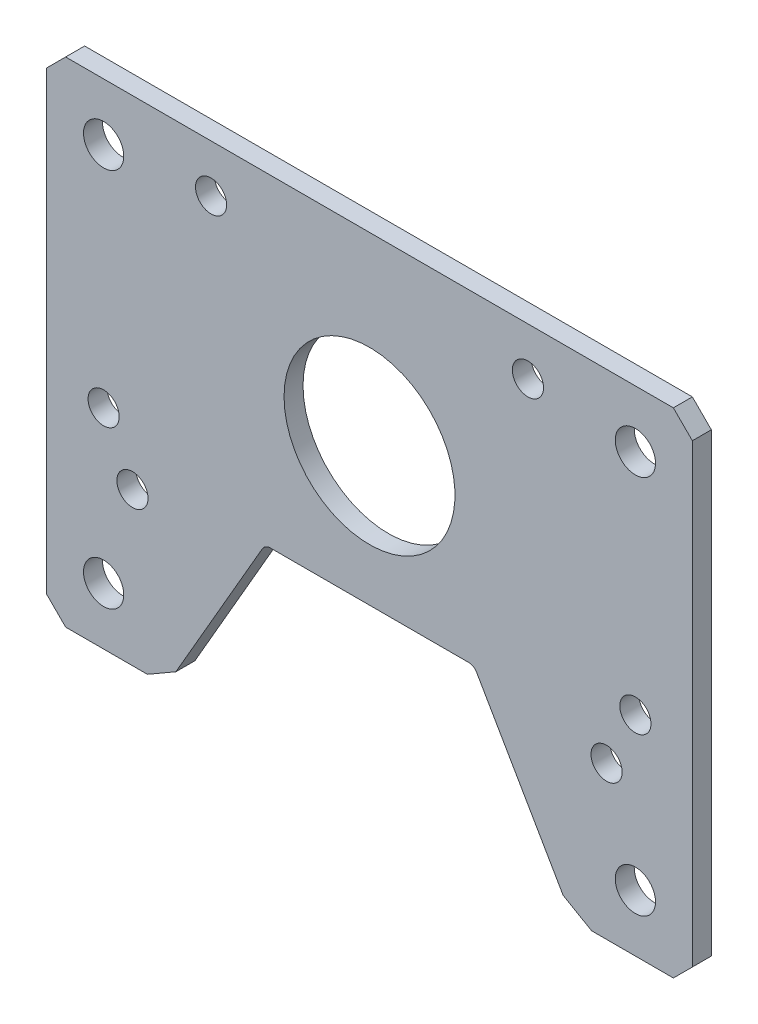
ISO-10303-21;
HEADER;
FILE_DESCRIPTION(('STEP AP214'),'2;1');
FILE_NAME('part.step','',(''),(''),'','','');
FILE_SCHEMA(('AUTOMOTIVE_DESIGN { 1 0 10303 214 1 1 1 1 }'));
ENDSEC;
DATA;
#1=APPLICATION_CONTEXT('core data for automotive mechanical design processes');
#2=APPLICATION_PROTOCOL_DEFINITION('international standard','automotive_design',2000,#1);
#3=PRODUCT_CONTEXT('',#1,'mechanical');
#4=PRODUCT('Part','Part','',(#3));
#5=PRODUCT_RELATED_PRODUCT_CATEGORY('part','',(#4));
#6=PRODUCT_DEFINITION_FORMATION('','',#4);
#7=PRODUCT_DEFINITION_CONTEXT('part definition',#1,'design');
#8=PRODUCT_DEFINITION('design','',#6,#7);
#9=PRODUCT_DEFINITION_SHAPE('','',#8);
#10=(LENGTH_UNIT() NAMED_UNIT(*) SI_UNIT(.MILLI.,.METRE.));
#11=(NAMED_UNIT(*) PLANE_ANGLE_UNIT() SI_UNIT($,.RADIAN.));
#12=(NAMED_UNIT(*) SI_UNIT($,.STERADIAN.) SOLID_ANGLE_UNIT());
#13=UNCERTAINTY_MEASURE_WITH_UNIT(LENGTH_MEASURE(1.E-05),#10,'distance_accuracy_value','');
#14=(GEOMETRIC_REPRESENTATION_CONTEXT(3) GLOBAL_UNCERTAINTY_ASSIGNED_CONTEXT((#13)) GLOBAL_UNIT_ASSIGNED_CONTEXT((#10,
#11,#12)) REPRESENTATION_CONTEXT('',''));
#15=CARTESIAN_POINT('',(0.,0.,0.));
#16=DIRECTION('',(0.,0.,1.));
#17=DIRECTION('',(1.,0.,0.));
#18=AXIS2_PLACEMENT_3D('',#15,#16,#17);
#19=CARTESIAN_POINT('',(-16.5459564476615,-1.5875,3.175));
#20=DIRECTION('',(0.,0.,1.));
#21=DIRECTION('',(1.,0.,0.));
#22=AXIS2_PLACEMENT_3D('',#19,#20,#21);
#23=CYLINDRICAL_SURFACE('',#22,1.5875);
#24=DIRECTION('',(0.,0.,1.));
#25=VECTOR('',#24,1.);
#26=CARTESIAN_POINT('',(-17.9207717761693,-0.793750000000006,3.175));
#27=LINE('',#26,#25);
#28=CARTESIAN_POINT('',(-17.9207717761693,-0.793750000000005,3.175));
#29=VERTEX_POINT('',#28);
#30=CARTESIAN_POINT('',(-17.9207717761693,-0.793750000000005,0.));
#31=VERTEX_POINT('',#30);
#32=EDGE_CURVE('E144',#29,#31,#27,.F.);
#33=ORIENTED_EDGE('',*,*,#32,.T.);
#34=CARTESIAN_POINT('',(-16.5459564476615,-1.5875,0.));
#35=DIRECTION('',(0.,0.,1.));
#36=DIRECTION('',(1.,0.,0.));
#37=AXIS2_PLACEMENT_3D('',#34,#35,#36);
#38=CIRCLE('',#37,1.5875);
#39=CARTESIAN_POINT('',(-16.5459564476615,0.,0.));
#40=VERTEX_POINT('',#39);
#41=EDGE_CURVE('E20',#40,#31,#38,.T.);
#42=ORIENTED_EDGE('',*,*,#41,.F.);
#43=DIRECTION('',(0.,0.,1.));
#44=VECTOR('',#43,1.);
#45=CARTESIAN_POINT('',(-16.5459564476615,0.,3.175));
#46=LINE('',#45,#44);
#47=CARTESIAN_POINT('',(-16.5459564476615,0.,3.175));
#48=VERTEX_POINT('',#47);
#49=EDGE_CURVE('E149',#40,#48,#46,.T.);
#50=ORIENTED_EDGE('',*,*,#49,.T.);
#51=CARTESIAN_POINT('',(-16.5459564476615,-1.5875,3.175));
#52=DIRECTION('',(0.,0.,1.));
#53=DIRECTION('',(1.,0.,0.));
#54=AXIS2_PLACEMENT_3D('',#51,#52,#53);
#55=CIRCLE('',#54,1.5875);
#56=EDGE_CURVE('E145',#29,#48,#55,.F.);
#57=ORIENTED_EDGE('',*,*,#56,.F.);
#58=EDGE_LOOP('',(#33,#42,#50,#57));
#59=FACE_BOUND('',#58,.T.);
#60=ADVANCED_FACE('F17',(#59),#23,.F.);
#61=CARTESIAN_POINT('',(16.5459564476615,-1.5875,3.175));
#62=DIRECTION('',(0.,0.,1.));
#63=DIRECTION('',(1.,0.,0.));
#64=AXIS2_PLACEMENT_3D('',#61,#62,#63);
#65=CYLINDRICAL_SURFACE('',#64,1.5875);
#66=DIRECTION('',(0.,0.,1.));
#67=VECTOR('',#66,1.);
#68=CARTESIAN_POINT('',(16.5459564476615,0.,3.175));
#69=LINE('',#68,#67);
#70=CARTESIAN_POINT('',(16.5459564476615,0.,3.175));
#71=VERTEX_POINT('',#70);
#72=CARTESIAN_POINT('',(16.5459564476615,0.,0.));
#73=VERTEX_POINT('',#72);
#74=EDGE_CURVE('E203',#71,#73,#69,.F.);
#75=ORIENTED_EDGE('',*,*,#74,.T.);
#76=CARTESIAN_POINT('',(16.5459564476615,-1.5875,0.));
#77=DIRECTION('',(0.,0.,1.));
#78=DIRECTION('',(1.,0.,0.));
#79=AXIS2_PLACEMENT_3D('',#76,#77,#78);
#80=CIRCLE('',#79,1.5875);
#81=CARTESIAN_POINT('',(17.9207717761693,-0.793749999999998,0.));
#82=VERTEX_POINT('',#81);
#83=EDGE_CURVE('E142',#82,#73,#80,.T.);
#84=ORIENTED_EDGE('',*,*,#83,.F.);
#85=DIRECTION('',(0.,0.,1.));
#86=VECTOR('',#85,1.);
#87=CARTESIAN_POINT('',(17.9207717761693,-0.793749999999998,3.175));
#88=LINE('',#87,#86);
#89=CARTESIAN_POINT('',(17.9207717761693,-0.793749999999998,3.175));
#90=VERTEX_POINT('',#89);
#91=EDGE_CURVE('E199',#82,#90,#88,.T.);
#92=ORIENTED_EDGE('',*,*,#91,.T.);
#93=CARTESIAN_POINT('',(16.5459564476615,-1.5875,3.175));
#94=DIRECTION('',(0.,0.,1.));
#95=DIRECTION('',(1.,0.,0.));
#96=AXIS2_PLACEMENT_3D('',#93,#94,#95);
#97=CIRCLE('',#96,1.5875);
#98=EDGE_CURVE('E341',#71,#90,#97,.F.);
#99=ORIENTED_EDGE('',*,*,#98,.F.);
#100=EDGE_LOOP('',(#75,#84,#92,#99));
#101=FACE_BOUND('',#100,.T.);
#102=ADVANCED_FACE('F349',(#101),#65,.F.);
#103=CARTESIAN_POINT('',(-53.975,-28.575,3.175));
#104=DIRECTION('',(0.,0.,1.));
#105=DIRECTION('',(1.,0.,0.));
#106=AXIS2_PLACEMENT_3D('',#103,#104,#105);
#107=PLANE('',#106);
#108=CARTESIAN_POINT('',(44.45,6.35000000000001,3.175));
#109=DIRECTION('',(0.,0.,-1.));
#110=DIRECTION('',(-1.,0.,0.));
#111=AXIS2_PLACEMENT_3D('',#108,#109,#110);
#112=CIRCLE('',#111,2.6035);
#113=CARTESIAN_POINT('',(41.8465,6.35000000000001,3.175));
#114=VERTEX_POINT('',#113);
#115=EDGE_CURVE('E310',#114,#114,#112,.T.);
#116=ORIENTED_EDGE('',*,*,#115,.T.);
#117=EDGE_LOOP('',(#116));
#118=FACE_BOUND('',#117,.T.);
#119=CARTESIAN_POINT('',(26.4841012047918,46.0057498114846,3.175));
#120=DIRECTION('',(0.,0.,-1.));
#121=DIRECTION('',(-1.,0.,0.));
#122=AXIS2_PLACEMENT_3D('',#119,#120,#121);
#123=CIRCLE('',#122,2.6035);
#124=CARTESIAN_POINT('',(23.8806012047918,46.0057498114846,3.175));
#125=VERTEX_POINT('',#124);
#126=EDGE_CURVE('E313',#125,#125,#123,.T.);
#127=ORIENTED_EDGE('',*,*,#126,.T.);
#128=EDGE_LOOP('',(#127));
#129=FACE_BOUND('',#128,.T.);
#130=CARTESIAN_POINT('',(-39.632108696,-3.06328216400001,3.175));
#131=DIRECTION('',(0.,0.,-1.));
#132=DIRECTION('',(-1.,0.,0.));
#133=AXIS2_PLACEMENT_3D('',#130,#131,#132);
#134=CIRCLE('',#133,2.6035);
#135=CARTESIAN_POINT('',(-42.235608696,-3.06328216400001,3.175));
#136=VERTEX_POINT('',#135);
#137=EDGE_CURVE('E316',#136,#136,#134,.T.);
#138=ORIENTED_EDGE('',*,*,#137,.T.);
#139=EDGE_LOOP('',(#138));
#140=FACE_BOUND('',#139,.T.);
#141=CARTESIAN_POINT('',(44.45,-19.05,3.175));
#142=DIRECTION('',(0.,0.,-1.));
#143=DIRECTION('',(-1.,0.,0.));
#144=AXIS2_PLACEMENT_3D('',#141,#142,#143);
#145=CIRCLE('',#144,3.3655);
#146=CARTESIAN_POINT('',(41.0845,-19.05,3.175));
#147=VERTEX_POINT('',#146);
#148=EDGE_CURVE('E319',#147,#147,#145,.T.);
#149=ORIENTED_EDGE('',*,*,#148,.T.);
#150=EDGE_LOOP('',(#149));
#151=FACE_BOUND('',#150,.T.);
#152=CARTESIAN_POINT('',(44.45,44.45,3.175));
#153=DIRECTION('',(0.,0.,-1.));
#154=DIRECTION('',(-1.,0.,0.));
#155=AXIS2_PLACEMENT_3D('',#152,#153,#154);
#156=CIRCLE('',#155,3.3655);
#157=CARTESIAN_POINT('',(41.0845,44.45,3.175));
#158=VERTEX_POINT('',#157);
#159=EDGE_CURVE('E322',#158,#158,#156,.T.);
#160=ORIENTED_EDGE('',*,*,#159,.T.);
#161=EDGE_LOOP('',(#160));
#162=FACE_BOUND('',#161,.T.);
#163=CARTESIAN_POINT('',(0.,23.058733918,3.175));
#164=DIRECTION('',(0.,0.,-1.));
#165=DIRECTION('',(-1.,0.,0.));
#166=AXIS2_PLACEMENT_3D('',#163,#164,#165);
#167=CIRCLE('',#166,14.2875);
#168=CARTESIAN_POINT('',(-14.2875,23.058733918,3.175));
#169=VERTEX_POINT('',#168);
#170=EDGE_CURVE('E263',#169,#169,#167,.T.);
#171=ORIENTED_EDGE('',*,*,#170,.T.);
#172=EDGE_LOOP('',(#171));
#173=FACE_BOUND('',#172,.T.);
#174=DIRECTION('',(0.,1.,0.));
#175=VECTOR('',#174,1.);
#176=CARTESIAN_POINT('',(53.975,53.975,3.175));
#177=LINE('',#176,#175);
#178=CARTESIAN_POINT('',(53.975,-25.4,3.175));
#179=VERTEX_POINT('',#178);
#180=CARTESIAN_POINT('',(53.975,50.8,3.175));
#181=VERTEX_POINT('',#180);
#182=EDGE_CURVE('E183',#179,#181,#177,.T.);
#183=ORIENTED_EDGE('',*,*,#182,.T.);
#184=DIRECTION('',(0.707106781186548,-0.707106781186548,0.));
#185=VECTOR('',#184,1.);
#186=CARTESIAN_POINT('',(50.8,53.975,3.175));
#187=LINE('',#186,#185);
#188=CARTESIAN_POINT('',(50.8,53.975,3.175));
#189=VERTEX_POINT('',#188);
#190=EDGE_CURVE('E178',#181,#189,#187,.F.);
#191=ORIENTED_EDGE('',*,*,#190,.T.);
#192=DIRECTION('',(1.,0.,0.));
#193=VECTOR('',#192,1.);
#194=CARTESIAN_POINT('',(-53.975,53.975,3.175));
#195=LINE('',#194,#193);
#196=CARTESIAN_POINT('',(-50.8,53.975,3.175));
#197=VERTEX_POINT('',#196);
#198=EDGE_CURVE('E173',#189,#197,#195,.F.);
#199=ORIENTED_EDGE('',*,*,#198,.T.);
#200=DIRECTION('',(0.707106781186548,0.707106781186548,0.));
#201=VECTOR('',#200,1.);
#202=CARTESIAN_POINT('',(-53.975,50.8,3.175));
#203=LINE('',#202,#201);
#204=CARTESIAN_POINT('',(-53.975,50.8,3.175));
#205=VERTEX_POINT('',#204);
#206=EDGE_CURVE('E168',#197,#205,#203,.F.);
#207=ORIENTED_EDGE('',*,*,#206,.T.);
#208=DIRECTION('',(0.,1.,0.));
#209=VECTOR('',#208,1.);
#210=CARTESIAN_POINT('',(-53.975,53.975,3.175));
#211=LINE('',#210,#209);
#212=CARTESIAN_POINT('',(-53.975,-25.4,3.175));
#213=VERTEX_POINT('',#212);
#214=EDGE_CURVE('E166',#205,#213,#211,.F.);
#215=ORIENTED_EDGE('',*,*,#214,.T.);
#216=DIRECTION('',(-0.707106781186548,0.707106781186548,0.));
#217=VECTOR('',#216,1.);
#218=CARTESIAN_POINT('',(-50.8,-28.575,3.175));
#219=LINE('',#218,#217);
#220=CARTESIAN_POINT('',(-50.8,-28.575,3.175));
#221=VERTEX_POINT('',#220);
#222=EDGE_CURVE('E239',#213,#221,#219,.F.);
#223=ORIENTED_EDGE('',*,*,#222,.T.);
#224=DIRECTION('',(1.,0.,0.));
#225=VECTOR('',#224,1.);
#226=CARTESIAN_POINT('',(-53.975,-28.575,3.175));
#227=LINE('',#226,#225);
#228=CARTESIAN_POINT('',(-37.1352839420935,-28.575,3.175));
#229=VERTEX_POINT('',#228);
#230=EDGE_CURVE('E228',#221,#229,#227,.T.);
#231=ORIENTED_EDGE('',*,*,#230,.T.);
#232=DIRECTION('',(-0.866025403784438,-0.500000000000002,0.));
#233=VECTOR('',#232,1.);
#234=CARTESIAN_POINT('',(-32.3727839420934,-25.8253693429844,3.175));
#235=LINE('',#234,#233);
#236=CARTESIAN_POINT('',(-32.3727839420934,-25.8253693429844,3.175));
#237=VERTEX_POINT('',#236);
#238=EDGE_CURVE('E220',#229,#237,#235,.F.);
#239=ORIENTED_EDGE('',*,*,#238,.T.);
#240=DIRECTION('',(-0.499999999999998,-0.86602540378444,0.));
#241=VECTOR('',#240,1.);
#242=CARTESIAN_POINT('',(-33.9602839420935,-28.575,3.175));
#243=LINE('',#242,#241);
#244=EDGE_CURVE('E150',#237,#29,#243,.F.);
#245=ORIENTED_EDGE('',*,*,#244,.T.);
#246=ORIENTED_EDGE('',*,*,#56,.T.);
#247=DIRECTION('',(-1.,0.,0.));
#248=VECTOR('',#247,1.);
#249=CARTESIAN_POINT('',(-17.4625,0.,3.175));
#250=LINE('',#249,#248);
#251=EDGE_CURVE('E216',#48,#71,#250,.F.);
#252=ORIENTED_EDGE('',*,*,#251,.T.);
#253=ORIENTED_EDGE('',*,*,#98,.T.);
#254=DIRECTION('',(-0.499999999999998,0.86602540378444,0.));
#255=VECTOR('',#254,1.);
#256=CARTESIAN_POINT('',(17.4625,0.,3.175));
#257=LINE('',#256,#255);
#258=CARTESIAN_POINT('',(32.3727839420935,-25.8253693429844,3.175));
#259=VERTEX_POINT('',#258);
#260=EDGE_CURVE('E202',#90,#259,#257,.F.);
#261=ORIENTED_EDGE('',*,*,#260,.T.);
#262=DIRECTION('',(-0.866025403784438,0.500000000000001,0.));
#263=VECTOR('',#262,1.);
#264=CARTESIAN_POINT('',(37.1352839420935,-28.575,3.175));
#265=LINE('',#264,#263);
#266=CARTESIAN_POINT('',(37.1352839420935,-28.575,3.175));
#267=VERTEX_POINT('',#266);
#268=EDGE_CURVE('E198',#259,#267,#265,.F.);
#269=ORIENTED_EDGE('',*,*,#268,.T.);
#270=DIRECTION('',(-1.,0.,0.));
#271=VECTOR('',#270,1.);
#272=CARTESIAN_POINT('',(33.9602839420935,-28.575,3.175));
#273=LINE('',#272,#271);
#274=CARTESIAN_POINT('',(50.8,-28.575,3.175));
#275=VERTEX_POINT('',#274);
#276=EDGE_CURVE('E193',#267,#275,#273,.F.);
#277=ORIENTED_EDGE('',*,*,#276,.T.);
#278=DIRECTION('',(-0.707106781186548,-0.707106781186548,0.));
#279=VECTOR('',#278,1.);
#280=CARTESIAN_POINT('',(53.975,-25.4,3.175));
#281=LINE('',#280,#279);
#282=EDGE_CURVE('E188',#275,#179,#281,.F.);
#283=ORIENTED_EDGE('',*,*,#282,.T.);
#284=EDGE_LOOP('',(#183,#191,#199,#207,#215,#223,#231,#239,#245,#246,#252,#253,#261,#269,#277,#283));
#285=FACE_BOUND('',#284,.T.);
#286=CARTESIAN_POINT('',(-44.45,44.45,3.175));
#287=DIRECTION('',(0.,0.,-1.));
#288=DIRECTION('',(-1.,0.,0.));
#289=AXIS2_PLACEMENT_3D('',#286,#287,#288);
#290=CIRCLE('',#289,3.3655);
#291=CARTESIAN_POINT('',(-47.8155,44.45,3.175));
#292=VERTEX_POINT('',#291);
#293=EDGE_CURVE('E258',#292,#292,#290,.T.);
#294=ORIENTED_EDGE('',*,*,#293,.T.);
#295=EDGE_LOOP('',(#294));
#296=FACE_BOUND('',#295,.T.);
#297=CARTESIAN_POINT('',(-44.45,-19.05,3.175));
#298=DIRECTION('',(0.,0.,-1.));
#299=DIRECTION('',(-1.,0.,0.));
#300=AXIS2_PLACEMENT_3D('',#297,#298,#299);
#301=CIRCLE('',#300,3.3655);
#302=CARTESIAN_POINT('',(-47.8155,-19.05,3.175));
#303=VERTEX_POINT('',#302);
#304=EDGE_CURVE('E329',#303,#303,#301,.T.);
#305=ORIENTED_EDGE('',*,*,#304,.T.);
#306=EDGE_LOOP('',(#305));
#307=FACE_BOUND('',#306,.T.);
#308=CARTESIAN_POINT('',(-44.45,6.34999999999999,3.175));
#309=DIRECTION('',(0.,0.,-1.));
#310=DIRECTION('',(-1.,0.,0.));
#311=AXIS2_PLACEMENT_3D('',#308,#309,#310);
#312=CIRCLE('',#311,2.6035);
#313=CARTESIAN_POINT('',(-47.0535,6.34999999999999,3.175));
#314=VERTEX_POINT('',#313);
#315=EDGE_CURVE('E332',#314,#314,#312,.T.);
#316=ORIENTED_EDGE('',*,*,#315,.T.);
#317=EDGE_LOOP('',(#316));
#318=FACE_BOUND('',#317,.T.);
#319=CARTESIAN_POINT('',(-26.4841012047918,46.0057498114846,3.175));
#320=DIRECTION('',(0.,0.,-1.));
#321=DIRECTION('',(-1.,0.,0.));
#322=AXIS2_PLACEMENT_3D('',#319,#320,#321);
#323=CIRCLE('',#322,2.6035);
#324=CARTESIAN_POINT('',(-29.0876012047918,46.0057498114846,3.175));
#325=VERTEX_POINT('',#324);
#326=EDGE_CURVE('E335',#325,#325,#323,.T.);
#327=ORIENTED_EDGE('',*,*,#326,.T.);
#328=EDGE_LOOP('',(#327));
#329=FACE_BOUND('',#328,.T.);
#330=CARTESIAN_POINT('',(39.632108696,-3.06328216400001,3.175));
#331=DIRECTION('',(0.,0.,-1.));
#332=DIRECTION('',(-1.,0.,0.));
#333=AXIS2_PLACEMENT_3D('',#330,#331,#332);
#334=CIRCLE('',#333,2.6035);
#335=CARTESIAN_POINT('',(37.028608696,-3.06328216400001,3.175));
#336=VERTEX_POINT('',#335);
#337=EDGE_CURVE('E338',#336,#336,#334,.T.);
#338=ORIENTED_EDGE('',*,*,#337,.T.);
#339=EDGE_LOOP('',(#338));
#340=FACE_BOUND('',#339,.T.);
#341=ADVANCED_FACE('F354',(#118,#129,#140,#151,#162,#173,#285,#296,#307,#318,#329,#340),#107,.T.);
#342=CARTESIAN_POINT('',(39.632108696,-3.06328216400001,3.175));
#343=DIRECTION('',(0.,0.,-1.));
#344=DIRECTION('',(-1.,0.,0.));
#345=AXIS2_PLACEMENT_3D('',#342,#343,#344);
#346=CYLINDRICAL_SURFACE('',#345,2.6035);
#347=CARTESIAN_POINT('',(39.632108696,-3.06328216400001,0.));
#348=DIRECTION('',(0.,0.,-1.));
#349=DIRECTION('',(-1.,0.,0.));
#350=AXIS2_PLACEMENT_3D('',#347,#348,#349);
#351=CIRCLE('',#350,2.6035);
#352=CARTESIAN_POINT('',(37.028608696,-3.06328216400001,0.));
#353=VERTEX_POINT('',#352);
#354=EDGE_CURVE('E307',#353,#353,#351,.T.);
#355=ORIENTED_EDGE('',*,*,#354,.T.);
#356=EDGE_LOOP('',(#355));
#357=FACE_BOUND('',#356,.T.);
#358=ORIENTED_EDGE('',*,*,#337,.F.);
#359=EDGE_LOOP('',(#358));
#360=FACE_BOUND('',#359,.T.);
#361=ADVANCED_FACE('F460',(#357,#360),#346,.F.);
#362=CARTESIAN_POINT('',(-26.4841012047918,46.0057498114846,3.175));
#363=DIRECTION('',(0.,0.,-1.));
#364=DIRECTION('',(-1.,0.,0.));
#365=AXIS2_PLACEMENT_3D('',#362,#363,#364);
#366=CYLINDRICAL_SURFACE('',#365,2.6035);
#367=CARTESIAN_POINT('',(-26.4841012047918,46.0057498114846,0.));
#368=DIRECTION('',(0.,0.,-1.));
#369=DIRECTION('',(-1.,0.,0.));
#370=AXIS2_PLACEMENT_3D('',#367,#368,#369);
#371=CIRCLE('',#370,2.6035);
#372=CARTESIAN_POINT('',(-29.0876012047918,46.0057498114846,0.));
#373=VERTEX_POINT('',#372);
#374=EDGE_CURVE('E304',#373,#373,#371,.T.);
#375=ORIENTED_EDGE('',*,*,#374,.T.);
#376=EDGE_LOOP('',(#375));
#377=FACE_BOUND('',#376,.T.);
#378=ORIENTED_EDGE('',*,*,#326,.F.);
#379=EDGE_LOOP('',(#378));
#380=FACE_BOUND('',#379,.T.);
#381=ADVANCED_FACE('F469',(#377,#380),#366,.F.);
#382=CARTESIAN_POINT('',(-44.45,6.34999999999999,3.175));
#383=DIRECTION('',(0.,0.,-1.));
#384=DIRECTION('',(-1.,0.,0.));
#385=AXIS2_PLACEMENT_3D('',#382,#383,#384);
#386=CYLINDRICAL_SURFACE('',#385,2.6035);
#387=CARTESIAN_POINT('',(-44.45,6.34999999999999,0.));
#388=DIRECTION('',(0.,0.,-1.));
#389=DIRECTION('',(-1.,0.,0.));
#390=AXIS2_PLACEMENT_3D('',#387,#388,#389);
#391=CIRCLE('',#390,2.6035);
#392=CARTESIAN_POINT('',(-47.0535,6.34999999999999,0.));
#393=VERTEX_POINT('',#392);
#394=EDGE_CURVE('E301',#393,#393,#391,.T.);
#395=ORIENTED_EDGE('',*,*,#394,.T.);
#396=EDGE_LOOP('',(#395));
#397=FACE_BOUND('',#396,.T.);
#398=ORIENTED_EDGE('',*,*,#315,.F.);
#399=EDGE_LOOP('',(#398));
#400=FACE_BOUND('',#399,.T.);
#401=ADVANCED_FACE('F476',(#397,#400),#386,.F.);
#402=CARTESIAN_POINT('',(-44.45,-19.05,3.175));
#403=DIRECTION('',(0.,0.,-1.));
#404=DIRECTION('',(-1.,0.,0.));
#405=AXIS2_PLACEMENT_3D('',#402,#403,#404);
#406=CYLINDRICAL_SURFACE('',#405,3.3655);
#407=CARTESIAN_POINT('',(-44.45,-19.05,0.));
#408=DIRECTION('',(0.,0.,-1.));
#409=DIRECTION('',(-1.,0.,0.));
#410=AXIS2_PLACEMENT_3D('',#407,#408,#409);
#411=CIRCLE('',#410,3.3655);
#412=CARTESIAN_POINT('',(-47.8155,-19.05,0.));
#413=VERTEX_POINT('',#412);
#414=EDGE_CURVE('E298',#413,#413,#411,.T.);
#415=ORIENTED_EDGE('',*,*,#414,.T.);
#416=EDGE_LOOP('',(#415));
#417=FACE_BOUND('',#416,.T.);
#418=ORIENTED_EDGE('',*,*,#304,.F.);
#419=EDGE_LOOP('',(#418));
#420=FACE_BOUND('',#419,.T.);
#421=ADVANCED_FACE('F480',(#417,#420),#406,.F.);
#422=CARTESIAN_POINT('',(-44.45,44.45,3.175));
#423=DIRECTION('',(0.,0.,-1.));
#424=DIRECTION('',(-1.,0.,0.));
#425=AXIS2_PLACEMENT_3D('',#422,#423,#424);
#426=CYLINDRICAL_SURFACE('',#425,3.3655);
#427=CARTESIAN_POINT('',(-44.45,44.45,0.));
#428=DIRECTION('',(0.,0.,-1.));
#429=DIRECTION('',(-1.,0.,0.));
#430=AXIS2_PLACEMENT_3D('',#427,#428,#429);
#431=CIRCLE('',#430,3.3655);
#432=CARTESIAN_POINT('',(-47.8155,44.45,0.));
#433=VERTEX_POINT('',#432);
#434=EDGE_CURVE('E244',#433,#433,#431,.T.);
#435=ORIENTED_EDGE('',*,*,#434,.T.);
#436=EDGE_LOOP('',(#435));
#437=FACE_BOUND('',#436,.T.);
#438=ORIENTED_EDGE('',*,*,#293,.F.);
#439=EDGE_LOOP('',(#438));
#440=FACE_BOUND('',#439,.T.);
#441=ADVANCED_FACE('F484',(#437,#440),#426,.F.);
#442=CARTESIAN_POINT('',(-50.8,-28.575,3.175));
#443=DIRECTION('',(0.707106781186548,0.707106781186548,0.));
#444=DIRECTION('',(-0.707106781186548,0.707106781186548,0.));
#445=AXIS2_PLACEMENT_3D('',#442,#443,#444);
#446=PLANE('',#445);
#447=DIRECTION('',(0.,0.,-1.));
#448=VECTOR('',#447,1.);
#449=CARTESIAN_POINT('',(-53.975,-25.4,3.175));
#450=LINE('',#449,#448);
#451=CARTESIAN_POINT('',(-53.975,-25.4,0.));
#452=VERTEX_POINT('',#451);
#453=EDGE_CURVE('E167',#213,#452,#450,.T.);
#454=ORIENTED_EDGE('',*,*,#453,.T.);
#455=DIRECTION('',(0.707106781186547,-0.707106781186547,0.));
#456=VECTOR('',#455,1.);
#457=CARTESIAN_POINT('',(-53.975,-25.4,0.));
#458=LINE('',#457,#456);
#459=CARTESIAN_POINT('',(-50.8,-28.575,0.));
#460=VERTEX_POINT('',#459);
#461=EDGE_CURVE('E233',#452,#460,#458,.T.);
#462=ORIENTED_EDGE('',*,*,#461,.T.);
#463=DIRECTION('',(0.,0.,1.));
#464=VECTOR('',#463,1.);
#465=CARTESIAN_POINT('',(-50.8,-28.575,3.175));
#466=LINE('',#465,#464);
#467=EDGE_CURVE('E236',#460,#221,#466,.T.);
#468=ORIENTED_EDGE('',*,*,#467,.T.);
#469=ORIENTED_EDGE('',*,*,#222,.F.);
#470=EDGE_LOOP('',(#454,#462,#468,#469));
#471=FACE_BOUND('',#470,.T.);
#472=ADVANCED_FACE('F365',(#471),#446,.F.);
#473=CARTESIAN_POINT('',(-53.975,-28.575,3.175));
#474=DIRECTION('',(0.,1.,0.));
#475=DIRECTION('',(0.,0.,1.));
#476=AXIS2_PLACEMENT_3D('',#473,#474,#475);
#477=PLANE('',#476);
#478=DIRECTION('',(0.,0.,1.));
#479=VECTOR('',#478,1.);
#480=CARTESIAN_POINT('',(-37.1352839420935,-28.575,3.175));
#481=LINE('',#480,#479);
#482=CARTESIAN_POINT('',(-37.1352839420935,-28.575,0.));
#483=VERTEX_POINT('',#482);
#484=EDGE_CURVE('E225',#483,#229,#481,.T.);
#485=ORIENTED_EDGE('',*,*,#484,.T.);
#486=ORIENTED_EDGE('',*,*,#230,.F.);
#487=ORIENTED_EDGE('',*,*,#467,.F.);
#488=DIRECTION('',(1.,0.,0.));
#489=VECTOR('',#488,1.);
#490=CARTESIAN_POINT('',(-53.975,-28.575,0.));
#491=LINE('',#490,#489);
#492=EDGE_CURVE('E159',#460,#483,#491,.T.);
#493=ORIENTED_EDGE('',*,*,#492,.T.);
#494=EDGE_LOOP('',(#485,#486,#487,#493));
#495=FACE_BOUND('',#494,.T.);
#496=ADVANCED_FACE('F362',(#495),#477,.F.);
#497=CARTESIAN_POINT('',(-32.3727839420934,-25.8253693429844,3.175));
#498=DIRECTION('',(-0.500000000000002,0.866025403784438,0.));
#499=DIRECTION('',(-0.866025403784438,-0.500000000000002,0.));
#500=AXIS2_PLACEMENT_3D('',#497,#498,#499);
#501=PLANE('',#500);
#502=ORIENTED_EDGE('',*,*,#484,.F.);
#503=DIRECTION('',(0.866025403784438,0.500000000000002,0.));
#504=VECTOR('',#503,1.);
#505=CARTESIAN_POINT('',(-37.1352839420935,-28.575,0.));
#506=LINE('',#505,#504);
#507=CARTESIAN_POINT('',(-32.3727839420934,-25.8253693429844,0.));
#508=VERTEX_POINT('',#507);
#509=EDGE_CURVE('E155',#483,#508,#506,.T.);
#510=ORIENTED_EDGE('',*,*,#509,.T.);
#511=DIRECTION('',(0.,0.,1.));
#512=VECTOR('',#511,1.);
#513=CARTESIAN_POINT('',(-32.3727839420934,-25.8253693429844,3.175));
#514=LINE('',#513,#512);
#515=EDGE_CURVE('E154',#508,#237,#514,.T.);
#516=ORIENTED_EDGE('',*,*,#515,.T.);
#517=ORIENTED_EDGE('',*,*,#238,.F.);
#518=EDGE_LOOP('',(#502,#510,#516,#517));
#519=FACE_BOUND('',#518,.T.);
#520=ADVANCED_FACE('F359',(#519),#501,.F.);
#521=CARTESIAN_POINT('',(-33.9602839420935,-28.575,3.175));
#522=DIRECTION('',(-0.86602540378444,0.499999999999998,0.));
#523=DIRECTION('',(-0.499999999999998,-0.86602540378444,0.));
#524=AXIS2_PLACEMENT_3D('',#521,#522,#523);
#525=PLANE('',#524);
#526=ORIENTED_EDGE('',*,*,#32,.F.);
#527=ORIENTED_EDGE('',*,*,#244,.F.);
#528=ORIENTED_EDGE('',*,*,#515,.F.);
#529=DIRECTION('',(0.499999999999998,0.86602540378444,0.));
#530=VECTOR('',#529,1.);
#531=CARTESIAN_POINT('',(-32.3727839420934,-25.8253693429844,0.));
#532=LINE('',#531,#530);
#533=EDGE_CURVE('E138',#508,#31,#532,.T.);
#534=ORIENTED_EDGE('',*,*,#533,.T.);
#535=EDGE_LOOP('',(#526,#527,#528,#534));
#536=FACE_BOUND('',#535,.T.);
#537=ADVANCED_FACE('F152',(#536),#525,.F.);
#538=CARTESIAN_POINT('',(-17.4625,0.,3.175));
#539=DIRECTION('',(0.,1.,0.));
#540=DIRECTION('',(-1.,0.,0.));
#541=AXIS2_PLACEMENT_3D('',#538,#539,#540);
#542=PLANE('',#541);
#543=ORIENTED_EDGE('',*,*,#74,.F.);
#544=ORIENTED_EDGE('',*,*,#251,.F.);
#545=ORIENTED_EDGE('',*,*,#49,.F.);
#546=DIRECTION('',(1.,0.,0.));
#547=VECTOR('',#546,1.);
#548=CARTESIAN_POINT('',(-53.975,0.,0.));
#549=LINE('',#548,#547);
#550=EDGE_CURVE('E141',#40,#73,#549,.T.);
#551=ORIENTED_EDGE('',*,*,#550,.T.);
#552=EDGE_LOOP('',(#543,#544,#545,#551));
#553=FACE_BOUND('',#552,.T.);
#554=ADVANCED_FACE('F352',(#553),#542,.F.);
#555=CARTESIAN_POINT('',(17.4625,0.,3.175));
#556=DIRECTION('',(0.86602540378444,0.499999999999998,0.));
#557=DIRECTION('',(-0.499999999999998,0.86602540378444,0.));
#558=AXIS2_PLACEMENT_3D('',#555,#556,#557);
#559=PLANE('',#558);
#560=ORIENTED_EDGE('',*,*,#91,.F.);
#561=DIRECTION('',(0.499999999999998,-0.86602540378444,0.));
#562=VECTOR('',#561,1.);
#563=CARTESIAN_POINT('',(17.9207717761693,-0.793749999999999,0.));
#564=LINE('',#563,#562);
#565=CARTESIAN_POINT('',(32.3727839420934,-25.8253693429844,0.));
#566=VERTEX_POINT('',#565);
#567=EDGE_CURVE('E157',#82,#566,#564,.T.);
#568=ORIENTED_EDGE('',*,*,#567,.T.);
#569=DIRECTION('',(0.,0.,1.));
#570=VECTOR('',#569,1.);
#571=CARTESIAN_POINT('',(32.3727839420935,-25.8253693429844,3.175));
#572=LINE('',#571,#570);
#573=EDGE_CURVE('E210',#566,#259,#572,.T.);
#574=ORIENTED_EDGE('',*,*,#573,.T.);
#575=ORIENTED_EDGE('',*,*,#260,.F.);
#576=EDGE_LOOP('',(#560,#568,#574,#575));
#577=FACE_BOUND('',#576,.T.);
#578=ADVANCED_FACE('F390',(#577),#559,.F.);
#579=CARTESIAN_POINT('',(37.1352839420935,-28.575,3.175));
#580=DIRECTION('',(0.500000000000001,0.866025403784438,0.));
#581=DIRECTION('',(-0.866025403784438,0.500000000000001,0.));
#582=AXIS2_PLACEMENT_3D('',#579,#580,#581);
#583=PLANE('',#582);
#584=ORIENTED_EDGE('',*,*,#573,.F.);
#585=DIRECTION('',(0.866025403784438,-0.5,0.));
#586=VECTOR('',#585,1.);
#587=CARTESIAN_POINT('',(32.3727839420934,-25.8253693429844,0.));
#588=LINE('',#587,#586);
#589=CARTESIAN_POINT('',(37.1352839420935,-28.575,0.));
#590=VERTEX_POINT('',#589);
#591=EDGE_CURVE('E204',#566,#590,#588,.T.);
#592=ORIENTED_EDGE('',*,*,#591,.T.);
#593=DIRECTION('',(0.,0.,1.));
#594=VECTOR('',#593,1.);
#595=CARTESIAN_POINT('',(37.1352839420935,-28.575,3.175));
#596=LINE('',#595,#594);
#597=EDGE_CURVE('E195',#590,#267,#596,.T.);
#598=ORIENTED_EDGE('',*,*,#597,.T.);
#599=ORIENTED_EDGE('',*,*,#268,.F.);
#600=EDGE_LOOP('',(#584,#592,#598,#599));
#601=FACE_BOUND('',#600,.T.);
#602=ADVANCED_FACE('F394',(#601),#583,.F.);
#603=CARTESIAN_POINT('',(33.9602839420935,-28.575,3.175));
#604=DIRECTION('',(0.,1.,0.));
#605=DIRECTION('',(-1.,0.,0.));
#606=AXIS2_PLACEMENT_3D('',#603,#604,#605);
#607=PLANE('',#606);
#608=DIRECTION('',(0.,0.,1.));
#609=VECTOR('',#608,1.);
#610=CARTESIAN_POINT('',(50.8,-28.575,3.175));
#611=LINE('',#610,#609);
#612=CARTESIAN_POINT('',(50.8,-28.575,0.));
#613=VERTEX_POINT('',#612);
#614=EDGE_CURVE('E190',#613,#275,#611,.T.);
#615=ORIENTED_EDGE('',*,*,#614,.T.);
#616=ORIENTED_EDGE('',*,*,#276,.F.);
#617=ORIENTED_EDGE('',*,*,#597,.F.);
#618=DIRECTION('',(1.,0.,0.));
#619=VECTOR('',#618,1.);
#620=CARTESIAN_POINT('',(-53.975,-28.575,0.));
#621=LINE('',#620,#619);
#622=EDGE_CURVE('E207',#590,#613,#621,.T.);
#623=ORIENTED_EDGE('',*,*,#622,.T.);
#624=EDGE_LOOP('',(#615,#616,#617,#623));
#625=FACE_BOUND('',#624,.T.);
#626=ADVANCED_FACE('F397',(#625),#607,.F.);
#627=CARTESIAN_POINT('',(53.975,-25.4,3.175));
#628=DIRECTION('',(-0.707106781186548,0.707106781186548,0.));
#629=DIRECTION('',(-0.707106781186548,-0.707106781186548,0.));
#630=AXIS2_PLACEMENT_3D('',#627,#628,#629);
#631=PLANE('',#630);
#632=ORIENTED_EDGE('',*,*,#614,.F.);
#633=DIRECTION('',(0.707106781186545,0.70710678118655,0.));
#634=VECTOR('',#633,1.);
#635=CARTESIAN_POINT('',(50.8,-28.575,0.));
#636=LINE('',#635,#634);
#637=CARTESIAN_POINT('',(53.975,-25.4,0.));
#638=VERTEX_POINT('',#637);
#639=EDGE_CURVE('E383',#613,#638,#636,.T.);
#640=ORIENTED_EDGE('',*,*,#639,.T.);
#641=DIRECTION('',(0.,0.,1.));
#642=VECTOR('',#641,1.);
#643=CARTESIAN_POINT('',(53.975,-25.4,3.175));
#644=LINE('',#643,#642);
#645=EDGE_CURVE('E185',#638,#179,#644,.T.);
#646=ORIENTED_EDGE('',*,*,#645,.T.);
#647=ORIENTED_EDGE('',*,*,#282,.F.);
#648=EDGE_LOOP('',(#632,#640,#646,#647));
#649=FACE_BOUND('',#648,.T.);
#650=ADVANCED_FACE('F402',(#649),#631,.F.);
#651=CARTESIAN_POINT('',(53.975,53.975,3.175));
#652=DIRECTION('',(-1.,0.,0.));
#653=DIRECTION('',(0.,0.,1.));
#654=AXIS2_PLACEMENT_3D('',#651,#652,#653);
#655=PLANE('',#654);
#656=DIRECTION('',(0.,0.,1.));
#657=VECTOR('',#656,1.);
#658=CARTESIAN_POINT('',(53.975,50.8,3.175));
#659=LINE('',#658,#657);
#660=CARTESIAN_POINT('',(53.975,50.8,0.));
#661=VERTEX_POINT('',#660);
#662=EDGE_CURVE('E180',#661,#181,#659,.T.);
#663=ORIENTED_EDGE('',*,*,#662,.T.);
#664=ORIENTED_EDGE('',*,*,#182,.F.);
#665=ORIENTED_EDGE('',*,*,#645,.F.);
#666=DIRECTION('',(0.,1.,0.));
#667=VECTOR('',#666,1.);
#668=CARTESIAN_POINT('',(53.975,-28.575,0.));
#669=LINE('',#668,#667);
#670=EDGE_CURVE('E380',#638,#661,#669,.T.);
#671=ORIENTED_EDGE('',*,*,#670,.T.);
#672=EDGE_LOOP('',(#663,#664,#665,#671));
#673=FACE_BOUND('',#672,.T.);
#674=ADVANCED_FACE('F407',(#673),#655,.F.);
#675=CARTESIAN_POINT('',(50.8,53.975,3.175));
#676=DIRECTION('',(-0.707106781186548,-0.707106781186548,0.));
#677=DIRECTION('',(0.707106781186548,-0.707106781186548,0.));
#678=AXIS2_PLACEMENT_3D('',#675,#676,#677);
#679=PLANE('',#678);
#680=ORIENTED_EDGE('',*,*,#662,.F.);
#681=DIRECTION('',(-0.707106781186551,0.707106781186544,0.));
#682=VECTOR('',#681,1.);
#683=CARTESIAN_POINT('',(53.975,50.8,0.));
#684=LINE('',#683,#682);
#685=CARTESIAN_POINT('',(50.8,53.975,0.));
#686=VERTEX_POINT('',#685);
#687=EDGE_CURVE('E375',#661,#686,#684,.T.);
#688=ORIENTED_EDGE('',*,*,#687,.T.);
#689=DIRECTION('',(0.,0.,-1.));
#690=VECTOR('',#689,1.);
#691=CARTESIAN_POINT('',(50.8,53.975,3.175));
#692=LINE('',#691,#690);
#693=EDGE_CURVE('E175',#686,#189,#692,.F.);
#694=ORIENTED_EDGE('',*,*,#693,.T.);
#695=ORIENTED_EDGE('',*,*,#190,.F.);
#696=EDGE_LOOP('',(#680,#688,#694,#695));
#697=FACE_BOUND('',#696,.T.);
#698=ADVANCED_FACE('F409',(#697),#679,.F.);
#699=CARTESIAN_POINT('',(-53.975,53.975,3.175));
#700=DIRECTION('',(0.,-1.,0.));
#701=DIRECTION('',(0.,0.,-1.));
#702=AXIS2_PLACEMENT_3D('',#699,#700,#701);
#703=PLANE('',#702);
#704=DIRECTION('',(0.,0.,1.));
#705=VECTOR('',#704,1.);
#706=CARTESIAN_POINT('',(-50.8,53.975,3.175));
#707=LINE('',#706,#705);
#708=CARTESIAN_POINT('',(-50.8,53.975,0.));
#709=VERTEX_POINT('',#708);
#710=EDGE_CURVE('E170',#709,#197,#707,.T.);
#711=ORIENTED_EDGE('',*,*,#710,.T.);
#712=ORIENTED_EDGE('',*,*,#198,.F.);
#713=ORIENTED_EDGE('',*,*,#693,.F.);
#714=DIRECTION('',(1.,0.,0.));
#715=VECTOR('',#714,1.);
#716=CARTESIAN_POINT('',(-53.975,53.975,0.));
#717=LINE('',#716,#715);
#718=EDGE_CURVE('E373',#686,#709,#717,.F.);
#719=ORIENTED_EDGE('',*,*,#718,.T.);
#720=EDGE_LOOP('',(#711,#712,#713,#719));
#721=FACE_BOUND('',#720,.T.);
#722=ADVANCED_FACE('F411',(#721),#703,.F.);
#723=CARTESIAN_POINT('',(-53.975,50.8,3.175));
#724=DIRECTION('',(0.707106781186548,-0.707106781186548,0.));
#725=DIRECTION('',(0.707106781186548,0.707106781186548,0.));
#726=AXIS2_PLACEMENT_3D('',#723,#724,#725);
#727=PLANE('',#726);
#728=ORIENTED_EDGE('',*,*,#710,.F.);
#729=DIRECTION('',(-0.707106781186547,-0.707106781186547,0.));
#730=VECTOR('',#729,1.);
#731=CARTESIAN_POINT('',(-50.8,53.975,0.));
#732=LINE('',#731,#730);
#733=CARTESIAN_POINT('',(-53.975,50.8,0.));
#734=VERTEX_POINT('',#733);
#735=EDGE_CURVE('E254',#709,#734,#732,.T.);
#736=ORIENTED_EDGE('',*,*,#735,.T.);
#737=DIRECTION('',(0.,0.,-1.));
#738=VECTOR('',#737,1.);
#739=CARTESIAN_POINT('',(-53.975,50.8,3.175));
#740=LINE('',#739,#738);
#741=EDGE_CURVE('E35',#734,#205,#740,.F.);
#742=ORIENTED_EDGE('',*,*,#741,.T.);
#743=ORIENTED_EDGE('',*,*,#206,.F.);
#744=EDGE_LOOP('',(#728,#736,#742,#743));
#745=FACE_BOUND('',#744,.T.);
#746=ADVANCED_FACE('F371',(#745),#727,.F.);
#747=CARTESIAN_POINT('',(-53.975,53.975,3.175));
#748=DIRECTION('',(1.,0.,0.));
#749=DIRECTION('',(0.,0.,-1.));
#750=AXIS2_PLACEMENT_3D('',#747,#748,#749);
#751=PLANE('',#750);
#752=ORIENTED_EDGE('',*,*,#741,.F.);
#753=DIRECTION('',(0.,1.,0.));
#754=VECTOR('',#753,1.);
#755=CARTESIAN_POINT('',(-53.975,-28.575,0.));
#756=LINE('',#755,#754);
#757=EDGE_CURVE('E251',#734,#452,#756,.F.);
#758=ORIENTED_EDGE('',*,*,#757,.T.);
#759=ORIENTED_EDGE('',*,*,#453,.F.);
#760=ORIENTED_EDGE('',*,*,#214,.F.);
#761=EDGE_LOOP('',(#752,#758,#759,#760));
#762=FACE_BOUND('',#761,.T.);
#763=ADVANCED_FACE('F413',(#762),#751,.F.);
#764=CARTESIAN_POINT('',(0.,23.058733918,3.175));
#765=DIRECTION('',(0.,0.,-1.));
#766=DIRECTION('',(-1.,0.,0.));
#767=AXIS2_PLACEMENT_3D('',#764,#765,#766);
#768=CYLINDRICAL_SURFACE('',#767,14.2875);
#769=CARTESIAN_POINT('',(0.,23.058733918,0.));
#770=DIRECTION('',(0.,0.,-1.));
#771=DIRECTION('',(-1.,0.,0.));
#772=AXIS2_PLACEMENT_3D('',#769,#770,#771);
#773=CIRCLE('',#772,14.2875);
#774=CARTESIAN_POINT('',(-14.2875,23.058733918,0.));
#775=VERTEX_POINT('',#774);
#776=EDGE_CURVE('E253',#775,#775,#773,.T.);
#777=ORIENTED_EDGE('',*,*,#776,.T.);
#778=EDGE_LOOP('',(#777));
#779=FACE_BOUND('',#778,.T.);
#780=ORIENTED_EDGE('',*,*,#170,.F.);
#781=EDGE_LOOP('',(#780));
#782=FACE_BOUND('',#781,.T.);
#783=ADVANCED_FACE('F415',(#779,#782),#768,.F.);
#784=CARTESIAN_POINT('',(44.45,44.45,3.175));
#785=DIRECTION('',(0.,0.,-1.));
#786=DIRECTION('',(-1.,0.,0.));
#787=AXIS2_PLACEMENT_3D('',#784,#785,#786);
#788=CYLINDRICAL_SURFACE('',#787,3.3655);
#789=CARTESIAN_POINT('',(44.45,44.45,0.));
#790=DIRECTION('',(0.,0.,-1.));
#791=DIRECTION('',(-1.,0.,0.));
#792=AXIS2_PLACEMENT_3D('',#789,#790,#791);
#793=CIRCLE('',#792,3.3655);
#794=CARTESIAN_POINT('',(41.0845,44.45,0.));
#795=VERTEX_POINT('',#794);
#796=EDGE_CURVE('E291',#795,#795,#793,.T.);
#797=ORIENTED_EDGE('',*,*,#796,.T.);
#798=EDGE_LOOP('',(#797));
#799=FACE_BOUND('',#798,.T.);
#800=ORIENTED_EDGE('',*,*,#159,.F.);
#801=EDGE_LOOP('',(#800));
#802=FACE_BOUND('',#801,.T.);
#803=ADVANCED_FACE('F422',(#799,#802),#788,.F.);
#804=CARTESIAN_POINT('',(44.45,-19.05,3.175));
#805=DIRECTION('',(0.,0.,-1.));
#806=DIRECTION('',(-1.,0.,0.));
#807=AXIS2_PLACEMENT_3D('',#804,#805,#806);
#808=CYLINDRICAL_SURFACE('',#807,3.3655);
#809=CARTESIAN_POINT('',(44.45,-19.05,0.));
#810=DIRECTION('',(0.,0.,-1.));
#811=DIRECTION('',(-1.,0.,0.));
#812=AXIS2_PLACEMENT_3D('',#809,#810,#811);
#813=CIRCLE('',#812,3.3655);
#814=CARTESIAN_POINT('',(41.0845,-19.05,0.));
#815=VERTEX_POINT('',#814);
#816=EDGE_CURVE('E288',#815,#815,#813,.T.);
#817=ORIENTED_EDGE('',*,*,#816,.T.);
#818=EDGE_LOOP('',(#817));
#819=FACE_BOUND('',#818,.T.);
#820=ORIENTED_EDGE('',*,*,#148,.F.);
#821=EDGE_LOOP('',(#820));
#822=FACE_BOUND('',#821,.T.);
#823=ADVANCED_FACE('F445',(#819,#822),#808,.F.);
#824=CARTESIAN_POINT('',(-39.632108696,-3.06328216400001,3.175));
#825=DIRECTION('',(0.,0.,-1.));
#826=DIRECTION('',(-1.,0.,0.));
#827=AXIS2_PLACEMENT_3D('',#824,#825,#826);
#828=CYLINDRICAL_SURFACE('',#827,2.6035);
#829=CARTESIAN_POINT('',(-39.632108696,-3.06328216400001,0.));
#830=DIRECTION('',(0.,0.,-1.));
#831=DIRECTION('',(-1.,0.,0.));
#832=AXIS2_PLACEMENT_3D('',#829,#830,#831);
#833=CIRCLE('',#832,2.6035);
#834=CARTESIAN_POINT('',(-42.235608696,-3.06328216400001,0.));
#835=VERTEX_POINT('',#834);
#836=EDGE_CURVE('E285',#835,#835,#833,.T.);
#837=ORIENTED_EDGE('',*,*,#836,.T.);
#838=EDGE_LOOP('',(#837));
#839=FACE_BOUND('',#838,.T.);
#840=ORIENTED_EDGE('',*,*,#137,.F.);
#841=EDGE_LOOP('',(#840));
#842=FACE_BOUND('',#841,.T.);
#843=ADVANCED_FACE('F441',(#839,#842),#828,.F.);
#844=CARTESIAN_POINT('',(26.4841012047918,46.0057498114846,3.175));
#845=DIRECTION('',(0.,0.,-1.));
#846=DIRECTION('',(-1.,0.,0.));
#847=AXIS2_PLACEMENT_3D('',#844,#845,#846);
#848=CYLINDRICAL_SURFACE('',#847,2.6035);
#849=CARTESIAN_POINT('',(26.4841012047918,46.0057498114846,0.));
#850=DIRECTION('',(0.,0.,-1.));
#851=DIRECTION('',(-1.,0.,0.));
#852=AXIS2_PLACEMENT_3D('',#849,#850,#851);
#853=CIRCLE('',#852,2.6035);
#854=CARTESIAN_POINT('',(23.8806012047918,46.0057498114846,0.));
#855=VERTEX_POINT('',#854);
#856=EDGE_CURVE('E26',#855,#855,#853,.T.);
#857=ORIENTED_EDGE('',*,*,#856,.T.);
#858=EDGE_LOOP('',(#857));
#859=FACE_BOUND('',#858,.T.);
#860=ORIENTED_EDGE('',*,*,#126,.F.);
#861=EDGE_LOOP('',(#860));
#862=FACE_BOUND('',#861,.T.);
#863=ADVANCED_FACE('F433',(#859,#862),#848,.F.);
#864=CARTESIAN_POINT('',(44.45,6.35000000000001,3.175));
#865=DIRECTION('',(0.,0.,-1.));
#866=DIRECTION('',(-1.,0.,0.));
#867=AXIS2_PLACEMENT_3D('',#864,#865,#866);
#868=CYLINDRICAL_SURFACE('',#867,2.6035);
#869=CARTESIAN_POINT('',(44.45,6.35000000000001,0.));
#870=DIRECTION('',(0.,0.,-1.));
#871=DIRECTION('',(-1.,0.,0.));
#872=AXIS2_PLACEMENT_3D('',#869,#870,#871);
#873=CIRCLE('',#872,2.6035);
#874=CARTESIAN_POINT('',(41.8465,6.35000000000001,0.));
#875=VERTEX_POINT('',#874);
#876=EDGE_CURVE('E11',#875,#875,#873,.T.);
#877=ORIENTED_EDGE('',*,*,#876,.T.);
#878=EDGE_LOOP('',(#877));
#879=FACE_BOUND('',#878,.T.);
#880=ORIENTED_EDGE('',*,*,#115,.F.);
#881=EDGE_LOOP('',(#880));
#882=FACE_BOUND('',#881,.T.);
#883=ADVANCED_FACE('F427',(#879,#882),#868,.F.);
#884=CARTESIAN_POINT('',(-53.975,-28.575,0.));
#885=DIRECTION('',(0.,0.,1.));
#886=DIRECTION('',(1.,0.,0.));
#887=AXIS2_PLACEMENT_3D('',#884,#885,#886);
#888=PLANE('',#887);
#889=ORIENTED_EDGE('',*,*,#876,.F.);
#890=EDGE_LOOP('',(#889));
#891=FACE_BOUND('',#890,.T.);
#892=ORIENTED_EDGE('',*,*,#856,.F.);
#893=EDGE_LOOP('',(#892));
#894=FACE_BOUND('',#893,.T.);
#895=ORIENTED_EDGE('',*,*,#836,.F.);
#896=EDGE_LOOP('',(#895));
#897=FACE_BOUND('',#896,.T.);
#898=ORIENTED_EDGE('',*,*,#816,.F.);
#899=EDGE_LOOP('',(#898));
#900=FACE_BOUND('',#899,.T.);
#901=ORIENTED_EDGE('',*,*,#796,.F.);
#902=EDGE_LOOP('',(#901));
#903=FACE_BOUND('',#902,.T.);
#904=ORIENTED_EDGE('',*,*,#776,.F.);
#905=EDGE_LOOP('',(#904));
#906=FACE_BOUND('',#905,.T.);
#907=ORIENTED_EDGE('',*,*,#735,.F.);
#908=ORIENTED_EDGE('',*,*,#718,.F.);
#909=ORIENTED_EDGE('',*,*,#687,.F.);
#910=ORIENTED_EDGE('',*,*,#670,.F.);
#911=ORIENTED_EDGE('',*,*,#639,.F.);
#912=ORIENTED_EDGE('',*,*,#622,.F.);
#913=ORIENTED_EDGE('',*,*,#591,.F.);
#914=ORIENTED_EDGE('',*,*,#567,.F.);
#915=ORIENTED_EDGE('',*,*,#83,.T.);
#916=ORIENTED_EDGE('',*,*,#550,.F.);
#917=ORIENTED_EDGE('',*,*,#41,.T.);
#918=ORIENTED_EDGE('',*,*,#533,.F.);
#919=ORIENTED_EDGE('',*,*,#509,.F.);
#920=ORIENTED_EDGE('',*,*,#492,.F.);
#921=ORIENTED_EDGE('',*,*,#461,.F.);
#922=ORIENTED_EDGE('',*,*,#757,.F.);
#923=EDGE_LOOP('',(#907,#908,#909,#910,#911,#912,#913,#914,#915,#916,#917,#918,#919,#920,#921,#922));
#924=FACE_BOUND('',#923,.T.);
#925=ORIENTED_EDGE('',*,*,#434,.F.);
#926=EDGE_LOOP('',(#925));
#927=FACE_BOUND('',#926,.T.);
#928=ORIENTED_EDGE('',*,*,#414,.F.);
#929=EDGE_LOOP('',(#928));
#930=FACE_BOUND('',#929,.T.);
#931=ORIENTED_EDGE('',*,*,#394,.F.);
#932=EDGE_LOOP('',(#931));
#933=FACE_BOUND('',#932,.T.);
#934=ORIENTED_EDGE('',*,*,#374,.F.);
#935=EDGE_LOOP('',(#934));
#936=FACE_BOUND('',#935,.T.);
#937=ORIENTED_EDGE('',*,*,#354,.F.);
#938=EDGE_LOOP('',(#937));
#939=FACE_BOUND('',#938,.T.);
#940=ADVANCED_FACE('F134',(#891,#894,#897,#900,#903,#906,#924,#927,#930,#933,#936,#939),#888,.F.);
#941=CLOSED_SHELL('',(#60,#102,#341,#361,#381,#401,#421,#441,#472,#496,#520,#537,#554,#578,#602,
#626,#650,#674,#698,#722,#746,#763,#783,#803,#823,#843,#863,#883,#940));
#942=MANIFOLD_SOLID_BREP('B1',#941);
#943=ADVANCED_BREP_SHAPE_REPRESENTATION('',(#18,#942),#14);
#944=SHAPE_DEFINITION_REPRESENTATION(#9,#943);
ENDSEC;
END-ISO-10303-21;
